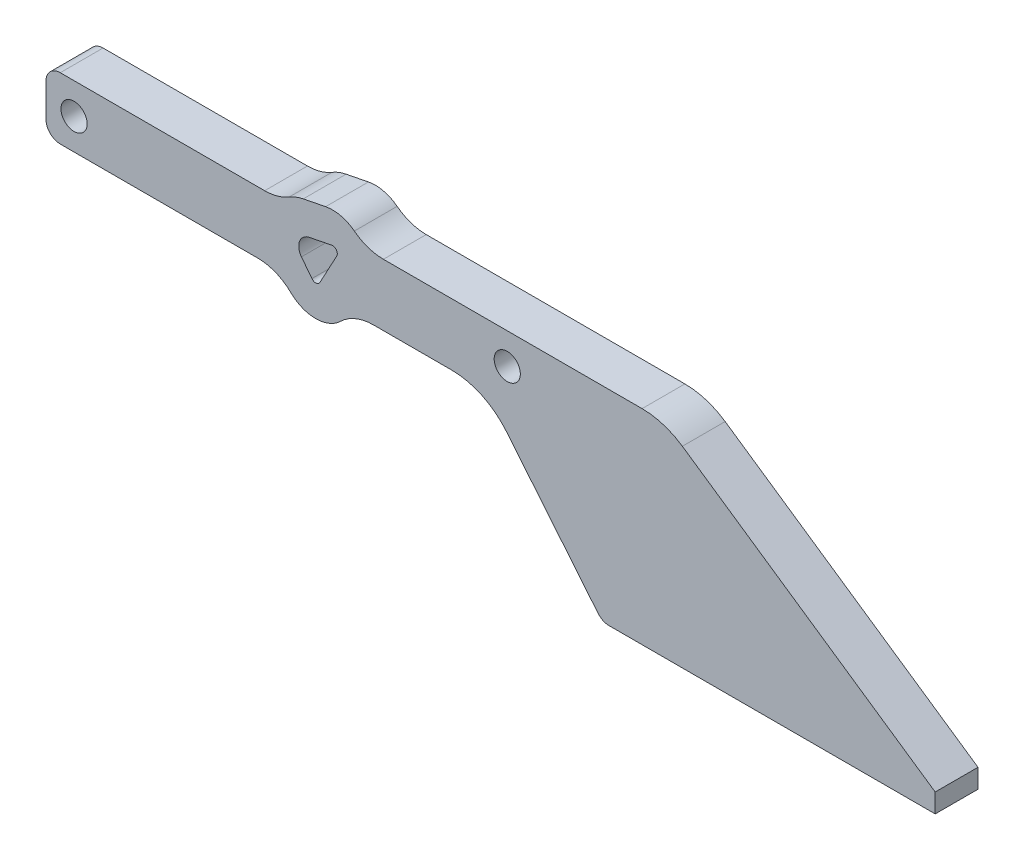
ISO-10303-21;
HEADER;
FILE_DESCRIPTION(('STEP AP214'),'2;1');
FILE_NAME('part.step','',(''),(''),'','','');
FILE_SCHEMA(('AUTOMOTIVE_DESIGN { 1 0 10303 214 1 1 1 1 }'));
ENDSEC;
DATA;
#1=APPLICATION_CONTEXT('core data for automotive mechanical design processes');
#2=APPLICATION_PROTOCOL_DEFINITION('international standard','automotive_design',2000,#1);
#3=PRODUCT_CONTEXT('',#1,'mechanical');
#4=PRODUCT('Part','Part','',(#3));
#5=PRODUCT_RELATED_PRODUCT_CATEGORY('part','',(#4));
#6=PRODUCT_DEFINITION_FORMATION('','',#4);
#7=PRODUCT_DEFINITION_CONTEXT('part definition',#1,'design');
#8=PRODUCT_DEFINITION('design','',#6,#7);
#9=PRODUCT_DEFINITION_SHAPE('','',#8);
#10=(LENGTH_UNIT() NAMED_UNIT(*) SI_UNIT(.MILLI.,.METRE.));
#11=(NAMED_UNIT(*) PLANE_ANGLE_UNIT() SI_UNIT($,.RADIAN.));
#12=(NAMED_UNIT(*) SI_UNIT($,.STERADIAN.) SOLID_ANGLE_UNIT());
#13=UNCERTAINTY_MEASURE_WITH_UNIT(LENGTH_MEASURE(1.E-05),#10,'distance_accuracy_value','');
#14=(GEOMETRIC_REPRESENTATION_CONTEXT(3) GLOBAL_UNCERTAINTY_ASSIGNED_CONTEXT((#13)) GLOBAL_UNIT_ASSIGNED_CONTEXT((#10,
#11,#12)) REPRESENTATION_CONTEXT('',''));
#15=CARTESIAN_POINT('',(0.,0.,0.));
#16=DIRECTION('',(0.,0.,1.));
#17=DIRECTION('',(1.,0.,0.));
#18=AXIS2_PLACEMENT_3D('',#15,#16,#17);
#19=CARTESIAN_POINT('',(-12.4346863309607,62.799754960396,4.5));
#20=DIRECTION('',(0.194234351219977,-0.980955155349191,0.));
#21=DIRECTION('',(0.980955155349191,0.194234351219977,0.));
#22=AXIS2_PLACEMENT_3D('',#19,#20,#21);
#23=PLANE('',#22);
#24=DIRECTION('',(-0.980955155349191,-0.194234351219977,0.));
#25=VECTOR('',#24,1.);
#26=CARTESIAN_POINT('',(-12.4346863309607,62.799754960396,-4.5));
#27=LINE('',#26,#25);
#28=CARTESIAN_POINT('',(-126.93136029778,40.1288030177724,-4.5));
#29=VERTEX_POINT('',#28);
#30=CARTESIAN_POINT('',(-131.634144465855,39.1976266772102,-4.5));
#31=VERTEX_POINT('',#30);
#32=EDGE_CURVE('E349',#29,#31,#27,.T.);
#33=ORIENTED_EDGE('',*,*,#32,.F.);
#34=DIRECTION('',(0.,0.,-1.));
#35=VECTOR('',#34,1.);
#36=CARTESIAN_POINT('',(-126.93136029778,40.1288030177724,4.5));
#37=LINE('',#36,#35);
#38=CARTESIAN_POINT('',(-126.93136029778,40.1288030177724,4.5));
#39=VERTEX_POINT('',#38);
#40=EDGE_CURVE('E380',#39,#29,#37,.T.);
#41=ORIENTED_EDGE('',*,*,#40,.F.);
#42=DIRECTION('',(-0.980955155349191,-0.194234351219977,0.));
#43=VECTOR('',#42,1.);
#44=CARTESIAN_POINT('',(-12.4346863309607,62.799754960396,4.5));
#45=LINE('',#44,#43);
#46=CARTESIAN_POINT('',(-131.634144465855,39.1976266772102,4.5));
#47=VERTEX_POINT('',#46);
#48=EDGE_CURVE('E291',#39,#47,#45,.T.);
#49=ORIENTED_EDGE('',*,*,#48,.T.);
#50=DIRECTION('',(0.,0.,-1.));
#51=VECTOR('',#50,1.);
#52=CARTESIAN_POINT('',(-131.634144465855,39.1976266772102,4.5));
#53=LINE('',#52,#51);
#54=EDGE_CURVE('E243',#47,#31,#53,.T.);
#55=ORIENTED_EDGE('',*,*,#54,.T.);
#56=EDGE_LOOP('',(#33,#41,#49,#55));
#57=FACE_BOUND('',#56,.T.);
#58=ADVANCED_FACE('F46',(#57),#23,.T.);
#59=CARTESIAN_POINT('',(-126.73712594656,39.1478478624232,4.5));
#60=DIRECTION('',(0.,0.,-1.));
#61=DIRECTION('',(-1.,0.,0.));
#62=AXIS2_PLACEMENT_3D('',#59,#60,#61);
#63=CYLINDRICAL_SURFACE('',#62,1.);
#64=CARTESIAN_POINT('',(-126.73712594656,39.1478478624232,-4.5));
#65=DIRECTION('',(0.,0.,1.));
#66=DIRECTION('',(1.,0.,0.));
#67=AXIS2_PLACEMENT_3D('',#64,#65,#66);
#68=CIRCLE('',#67,1.);
#69=CARTESIAN_POINT('',(-125.857075345755,38.6729679407337,-4.5));
#70=VERTEX_POINT('',#69);
#71=EDGE_CURVE('E352',#29,#70,#68,.F.);
#72=ORIENTED_EDGE('',*,*,#71,.T.);
#73=DIRECTION('',(0.,0.,-1.));
#74=VECTOR('',#73,1.);
#75=CARTESIAN_POINT('',(-125.857075345755,38.6729679407337,4.5));
#76=LINE('',#75,#74);
#77=CARTESIAN_POINT('',(-125.857075345755,38.6729679407337,4.5));
#78=VERTEX_POINT('',#77);
#79=EDGE_CURVE('E377',#78,#70,#76,.T.);
#80=ORIENTED_EDGE('',*,*,#79,.F.);
#81=CARTESIAN_POINT('',(-126.73712594656,39.1478478624232,4.5));
#82=DIRECTION('',(0.,0.,1.));
#83=DIRECTION('',(1.,0.,0.));
#84=AXIS2_PLACEMENT_3D('',#81,#82,#83);
#85=CIRCLE('',#84,1.);
#86=EDGE_CURVE('E294',#39,#78,#85,.F.);
#87=ORIENTED_EDGE('',*,*,#86,.F.);
#88=ORIENTED_EDGE('',*,*,#40,.T.);
#89=EDGE_LOOP('',(#72,#80,#87,#88));
#90=FACE_BOUND('',#89,.T.);
#91=ADVANCED_FACE('F505',(#90),#63,.F.);
#92=CARTESIAN_POINT('',(-113.637071329194,61.3191599261613,4.5));
#93=DIRECTION('',(0.880050600804368,-0.474879921689548,0.));
#94=DIRECTION('',(0.474879921689548,0.880050600804368,0.));
#95=AXIS2_PLACEMENT_3D('',#92,#93,#94);
#96=PLANE('',#95);
#97=DIRECTION('',(-0.474879921689548,-0.880050600804368,0.));
#98=VECTOR('',#97,1.);
#99=CARTESIAN_POINT('',(-113.637071329194,61.3191599261613,-4.5));
#100=LINE('',#99,#98);
#101=CARTESIAN_POINT('',(-129.40475054433,32.0983928800392,-4.5));
#102=VERTEX_POINT('',#101);
#103=EDGE_CURVE('E355',#70,#102,#100,.T.);
#104=ORIENTED_EDGE('',*,*,#103,.T.);
#105=DIRECTION('',(0.,0.,-1.));
#106=VECTOR('',#105,1.);
#107=CARTESIAN_POINT('',(-129.40475054433,32.0983928800392,4.5));
#108=LINE('',#107,#106);
#109=CARTESIAN_POINT('',(-129.40475054433,32.0983928800392,4.5));
#110=VERTEX_POINT('',#109);
#111=EDGE_CURVE('E375',#110,#102,#108,.T.);
#112=ORIENTED_EDGE('',*,*,#111,.F.);
#113=DIRECTION('',(-0.474879921689548,-0.880050600804368,0.));
#114=VECTOR('',#113,1.);
#115=CARTESIAN_POINT('',(-113.637071329194,61.3191599261613,4.5));
#116=LINE('',#115,#114);
#117=EDGE_CURVE('E297',#78,#110,#116,.T.);
#118=ORIENTED_EDGE('',*,*,#117,.F.);
#119=ORIENTED_EDGE('',*,*,#79,.T.);
#120=EDGE_LOOP('',(#104,#112,#118,#119));
#121=FACE_BOUND('',#120,.T.);
#122=ADVANCED_FACE('F511',(#121),#96,.F.);
#123=CARTESIAN_POINT('',(-130.284801145135,32.5732728017287,4.5));
#124=DIRECTION('',(0.,0.,-1.));
#125=DIRECTION('',(-1.,0.,0.));
#126=AXIS2_PLACEMENT_3D('',#123,#124,#125);
#127=CYLINDRICAL_SURFACE('',#126,1.00000000000001);
#128=CARTESIAN_POINT('',(-130.284801145135,32.5732728017287,-4.5));
#129=DIRECTION('',(0.,0.,1.));
#130=DIRECTION('',(1.,0.,0.));
#131=AXIS2_PLACEMENT_3D('',#128,#129,#130);
#132=CIRCLE('',#131,1.00000000000001);
#133=CARTESIAN_POINT('',(-131.07709078849,31.9631276378275,-4.5));
#134=VERTEX_POINT('',#133);
#135=EDGE_CURVE('E358',#134,#102,#132,.T.);
#136=ORIENTED_EDGE('',*,*,#135,.F.);
#137=DIRECTION('',(0.,0.,-1.));
#138=VECTOR('',#137,1.);
#139=CARTESIAN_POINT('',(-131.07709078849,31.9631276378275,4.5));
#140=LINE('',#139,#138);
#141=CARTESIAN_POINT('',(-131.07709078849,31.9631276378275,4.5));
#142=VERTEX_POINT('',#141);
#143=EDGE_CURVE('E373',#142,#134,#140,.T.);
#144=ORIENTED_EDGE('',*,*,#143,.F.);
#145=CARTESIAN_POINT('',(-130.284801145135,32.5732728017287,4.5));
#146=DIRECTION('',(0.,0.,1.));
#147=DIRECTION('',(1.,0.,0.));
#148=AXIS2_PLACEMENT_3D('',#145,#146,#147);
#149=CIRCLE('',#148,1.00000000000001);
#150=EDGE_CURVE('E299',#142,#110,#149,.T.);
#151=ORIENTED_EDGE('',*,*,#150,.T.);
#152=ORIENTED_EDGE('',*,*,#111,.T.);
#153=EDGE_LOOP('',(#136,#144,#151,#152));
#154=FACE_BOUND('',#153,.T.);
#155=ADVANCED_FACE('F771',(#154),#127,.F.);
#156=CARTESIAN_POINT('',(-66.8287391098888,-51.465057406079,4.5));
#157=DIRECTION('',(-0.792289643355201,-0.610145163901254,0.));
#158=DIRECTION('',(0.610145163901254,-0.792289643355201,0.));
#159=AXIS2_PLACEMENT_3D('',#156,#157,#158);
#160=PLANE('',#159);
#161=DIRECTION('',(-0.610145163901254,0.792289643355201,0.));
#162=VECTOR('',#161,1.);
#163=CARTESIAN_POINT('',(-66.8287391098888,-51.465057406079,-4.5));
#164=LINE('',#163,#162);
#165=CARTESIAN_POINT('',(-133.278796519227,34.8221007992715,-4.5));
#166=VERTEX_POINT('',#165);
#167=EDGE_CURVE('E361',#134,#166,#164,.T.);
#168=ORIENTED_EDGE('',*,*,#167,.T.);
#169=DIRECTION('',(0.,0.,-1.));
#170=VECTOR('',#169,1.);
#171=CARTESIAN_POINT('',(-133.278796519227,34.8221007992715,4.5));
#172=LINE('',#171,#170);
#173=CARTESIAN_POINT('',(-133.278796519227,34.8221007992715,4.5));
#174=VERTEX_POINT('',#173);
#175=EDGE_CURVE('E371',#174,#166,#172,.T.);
#176=ORIENTED_EDGE('',*,*,#175,.F.);
#177=DIRECTION('',(-0.610145163901254,0.792289643355201,0.));
#178=VECTOR('',#177,1.);
#179=CARTESIAN_POINT('',(-66.8287391098888,-51.465057406079,4.5));
#180=LINE('',#179,#178);
#181=EDGE_CURVE('E302',#142,#174,#180,.T.);
#182=ORIENTED_EDGE('',*,*,#181,.F.);
#183=ORIENTED_EDGE('',*,*,#143,.T.);
#184=EDGE_LOOP('',(#168,#176,#182,#183));
#185=FACE_BOUND('',#184,.T.);
#186=ADVANCED_FACE('F559',(#185),#160,.F.);
#187=CARTESIAN_POINT('',(0.,43.,4.5));
#188=DIRECTION('',(0.,-1.,0.));
#189=DIRECTION('',(1.,0.,0.));
#190=AXIS2_PLACEMENT_3D('',#187,#188,#189);
#191=PLANE('',#190);
#192=DIRECTION('',(-1.,0.,0.));
#193=VECTOR('',#192,1.);
#194=CARTESIAN_POINT('',(0.,43.,-4.5));
#195=LINE('',#194,#193);
#196=CARTESIAN_POINT('',(-61.6404563843569,43.,-4.5));
#197=VERTEX_POINT('',#196);
#198=CARTESIAN_POINT('',(-116.042833957025,43.,-4.5));
#199=VERTEX_POINT('',#198);
#200=EDGE_CURVE('E314',#197,#199,#195,.T.);
#201=ORIENTED_EDGE('',*,*,#200,.T.);
#202=DIRECTION('',(0.,0.,-1.));
#203=VECTOR('',#202,1.);
#204=CARTESIAN_POINT('',(-116.042833957025,43.,4.5));
#205=LINE('',#204,#203);
#206=CARTESIAN_POINT('',(-116.042833957025,43.,4.5));
#207=VERTEX_POINT('',#206);
#208=EDGE_CURVE('E416',#199,#207,#205,.F.);
#209=ORIENTED_EDGE('',*,*,#208,.T.);
#210=DIRECTION('',(-1.,0.,0.));
#211=VECTOR('',#210,1.);
#212=CARTESIAN_POINT('',(0.,43.,4.5));
#213=LINE('',#212,#211);
#214=CARTESIAN_POINT('',(-61.6404563843569,43.,4.5));
#215=VERTEX_POINT('',#214);
#216=EDGE_CURVE('E260',#215,#207,#213,.T.);
#217=ORIENTED_EDGE('',*,*,#216,.F.);
#218=DIRECTION('',(0.,0.,-1.));
#219=VECTOR('',#218,1.);
#220=CARTESIAN_POINT('',(-61.6404563843569,43.,-4.5));
#221=LINE('',#220,#219);
#222=EDGE_CURVE('E393',#215,#197,#221,.T.);
#223=ORIENTED_EDGE('',*,*,#222,.T.);
#224=EDGE_LOOP('',(#201,#209,#217,#223));
#225=FACE_BOUND('',#224,.T.);
#226=ADVANCED_FACE('F487',(#225),#191,.F.);
#227=CARTESIAN_POINT('',(-126.73712594656,39.1478478624232,4.5));
#228=DIRECTION('',(0.,0.,-1.));
#229=DIRECTION('',(-1.,0.,0.));
#230=AXIS2_PLACEMENT_3D('',#227,#228,#229);
#231=CYLINDRICAL_SURFACE('',#230,7.5);
#232=CARTESIAN_POINT('',(-126.73712594656,39.1478478624232,4.5));
#233=DIRECTION('',(0.,0.,1.));
#234=DIRECTION('',(1.,0.,0.));
#235=AXIS2_PLACEMENT_3D('',#232,#233,#234);
#236=CIRCLE('',#235,7.5);
#237=CARTESIAN_POINT('',(-128.19388358071,46.5050115275422,4.5));
#238=VERTEX_POINT('',#237);
#239=CARTESIAN_POINT('',(-122.153857951045,45.0844844928133,4.5));
#240=VERTEX_POINT('',#239);
#241=EDGE_CURVE('E237',#238,#240,#236,.F.);
#242=ORIENTED_EDGE('',*,*,#241,.T.);
#243=DIRECTION('',(0.,0.,-1.));
#244=VECTOR('',#243,1.);
#245=CARTESIAN_POINT('',(-122.153857951045,45.0844844928133,4.5));
#246=LINE('',#245,#244);
#247=CARTESIAN_POINT('',(-122.153857951045,45.0844844928133,-4.5));
#248=VERTEX_POINT('',#247);
#249=EDGE_CURVE('E414',#240,#248,#246,.T.);
#250=ORIENTED_EDGE('',*,*,#249,.T.);
#251=CARTESIAN_POINT('',(-126.73712594656,39.1478478624232,-4.5));
#252=DIRECTION('',(0.,0.,1.));
#253=DIRECTION('',(1.,0.,0.));
#254=AXIS2_PLACEMENT_3D('',#251,#252,#253);
#255=CIRCLE('',#254,7.5);
#256=CARTESIAN_POINT('',(-128.19388358071,46.5050115275422,-4.5));
#257=VERTEX_POINT('',#256);
#258=EDGE_CURVE('E240',#257,#248,#255,.F.);
#259=ORIENTED_EDGE('',*,*,#258,.F.);
#260=DIRECTION('',(0.,0.,-1.));
#261=VECTOR('',#260,1.);
#262=CARTESIAN_POINT('',(-128.19388358071,46.5050115275422,4.5));
#263=LINE('',#262,#261);
#264=EDGE_CURVE('E232',#238,#257,#263,.T.);
#265=ORIENTED_EDGE('',*,*,#264,.F.);
#266=EDGE_LOOP('',(#242,#250,#259,#265));
#267=FACE_BOUND('',#266,.T.);
#268=ADVANCED_FACE('F234',(#267),#231,.T.);
#269=CARTESIAN_POINT('',(-13.6972096138902,69.1759634701653,4.5));
#270=DIRECTION('',(0.194234351219973,-0.980955155349191,0.));
#271=DIRECTION('',(0.980955155349192,0.194234351219973,0.));
#272=AXIS2_PLACEMENT_3D('',#269,#270,#271);
#273=PLANE('',#272);
#274=DIRECTION('',(-0.980955155349191,-0.194234351219973,0.));
#275=VECTOR('',#274,1.);
#276=CARTESIAN_POINT('',(-13.6972096138902,69.1759634701653,-4.5));
#277=LINE('',#276,#275);
#278=CARTESIAN_POINT('',(-132.896667748785,45.57383518698,-4.5));
#279=VERTEX_POINT('',#278);
#280=EDGE_CURVE('E318',#257,#279,#277,.T.);
#281=ORIENTED_EDGE('',*,*,#280,.T.);
#282=DIRECTION('',(0.,0.,-1.));
#283=VECTOR('',#282,1.);
#284=CARTESIAN_POINT('',(-132.896667748785,45.57383518698,4.5));
#285=LINE('',#284,#283);
#286=CARTESIAN_POINT('',(-132.896667748785,45.57383518698,4.5));
#287=VERTEX_POINT('',#286);
#288=EDGE_CURVE('E244',#287,#279,#285,.T.);
#289=ORIENTED_EDGE('',*,*,#288,.F.);
#290=DIRECTION('',(-0.980955155349191,-0.194234351219973,0.));
#291=VECTOR('',#290,1.);
#292=CARTESIAN_POINT('',(-13.6972096138902,69.1759634701653,4.5));
#293=LINE('',#292,#291);
#294=EDGE_CURVE('E247',#238,#287,#293,.T.);
#295=ORIENTED_EDGE('',*,*,#294,.F.);
#296=ORIENTED_EDGE('',*,*,#264,.T.);
#297=EDGE_LOOP('',(#281,#289,#295,#296));
#298=FACE_BOUND('',#297,.T.);
#299=ADVANCED_FACE('F248',(#298),#273,.F.);
#300=CARTESIAN_POINT('',(-131.1,36.5,4.5));
#301=DIRECTION('',(0.,0.,-1.));
#302=DIRECTION('',(-1.,0.,0.));
#303=AXIS2_PLACEMENT_3D('',#300,#301,#302);
#304=CYLINDRICAL_SURFACE('',#303,9.24999999999999);
#305=CARTESIAN_POINT('',(-131.1,36.5,-4.5));
#306=DIRECTION('',(0.,0.,1.));
#307=DIRECTION('',(1.,0.,0.));
#308=AXIS2_PLACEMENT_3D('',#305,#306,#307);
#309=CIRCLE('',#308,9.24999999999999);
#310=CARTESIAN_POINT('',(-135.864478471149,44.4285714285714,-4.5));
#311=VERTEX_POINT('',#310);
#312=EDGE_CURVE('E320',#279,#311,#309,.T.);
#313=ORIENTED_EDGE('',*,*,#312,.T.);
#314=DIRECTION('',(0.,0.,-1.));
#315=VECTOR('',#314,1.);
#316=CARTESIAN_POINT('',(-135.864478471149,44.4285714285714,4.5));
#317=LINE('',#316,#315);
#318=CARTESIAN_POINT('',(-135.864478471149,44.4285714285714,4.5));
#319=VERTEX_POINT('',#318);
#320=EDGE_CURVE('E421',#311,#319,#317,.F.);
#321=ORIENTED_EDGE('',*,*,#320,.T.);
#322=CARTESIAN_POINT('',(-131.1,36.5,4.5));
#323=DIRECTION('',(0.,0.,1.));
#324=DIRECTION('',(1.,0.,0.));
#325=AXIS2_PLACEMENT_3D('',#322,#323,#324);
#326=CIRCLE('',#325,9.24999999999999);
#327=EDGE_CURVE('E252',#287,#319,#326,.T.);
#328=ORIENTED_EDGE('',*,*,#327,.F.);
#329=ORIENTED_EDGE('',*,*,#288,.T.);
#330=EDGE_LOOP('',(#313,#321,#328,#329));
#331=FACE_BOUND('',#330,.T.);
#332=ADVANCED_FACE('F548',(#331),#304,.T.);
#333=CARTESIAN_POINT('',(0.,43.,4.5));
#334=DIRECTION('',(0.,-1.,0.));
#335=DIRECTION('',(1.,0.,0.));
#336=AXIS2_PLACEMENT_3D('',#333,#334,#335);
#337=PLANE('',#336);
#338=DIRECTION('',(-1.,0.,0.));
#339=VECTOR('',#338,1.);
#340=CARTESIAN_POINT('',(0.,43.,-4.5));
#341=LINE('',#340,#339);
#342=CARTESIAN_POINT('',(-141.015266007526,43.,-4.5));
#343=VERTEX_POINT('',#342);
#344=CARTESIAN_POINT('',(-184.,43.,-4.5));
#345=VERTEX_POINT('',#344);
#346=EDGE_CURVE('E323',#343,#345,#341,.T.);
#347=ORIENTED_EDGE('',*,*,#346,.T.);
#348=DIRECTION('',(0.,0.,-1.));
#349=VECTOR('',#348,1.);
#350=CARTESIAN_POINT('',(-184.,43.,4.5));
#351=LINE('',#350,#349);
#352=CARTESIAN_POINT('',(-184.,43.,4.5));
#353=VERTEX_POINT('',#352);
#354=EDGE_CURVE('E451',#345,#353,#351,.F.);
#355=ORIENTED_EDGE('',*,*,#354,.T.);
#356=DIRECTION('',(-1.,0.,0.));
#357=VECTOR('',#356,1.);
#358=CARTESIAN_POINT('',(0.,43.,4.5));
#359=LINE('',#358,#357);
#360=CARTESIAN_POINT('',(-141.015266007526,43.,4.5));
#361=VERTEX_POINT('',#360);
#362=EDGE_CURVE('E268',#361,#353,#359,.T.);
#363=ORIENTED_EDGE('',*,*,#362,.F.);
#364=DIRECTION('',(0.,0.,1.));
#365=VECTOR('',#364,1.);
#366=CARTESIAN_POINT('',(-141.015266007526,43.,-4.5));
#367=LINE('',#366,#365);
#368=EDGE_CURVE('E418',#361,#343,#367,.F.);
#369=ORIENTED_EDGE('',*,*,#368,.T.);
#370=EDGE_LOOP('',(#347,#355,#363,#369));
#371=FACE_BOUND('',#370,.T.);
#372=ADVANCED_FACE('F544',(#371),#337,.F.);
#373=CARTESIAN_POINT('',(-187.,0.,4.5));
#374=DIRECTION('',(1.,0.,0.));
#375=DIRECTION('',(0.,0.,-1.));
#376=AXIS2_PLACEMENT_3D('',#373,#374,#375);
#377=PLANE('',#376);
#378=DIRECTION('',(0.,-1.,0.));
#379=VECTOR('',#378,1.);
#380=CARTESIAN_POINT('',(-187.,0.,4.5));
#381=LINE('',#380,#379);
#382=CARTESIAN_POINT('',(-187.,40.,4.5));
#383=VERTEX_POINT('',#382);
#384=CARTESIAN_POINT('',(-187.,33.,4.5));
#385=VERTEX_POINT('',#384);
#386=EDGE_CURVE('E270',#383,#385,#381,.T.);
#387=ORIENTED_EDGE('',*,*,#386,.F.);
#388=DIRECTION('',(0.,0.,-1.));
#389=VECTOR('',#388,1.);
#390=CARTESIAN_POINT('',(-187.,40.,4.5));
#391=LINE('',#390,#389);
#392=CARTESIAN_POINT('',(-187.,40.,-4.5));
#393=VERTEX_POINT('',#392);
#394=EDGE_CURVE('E442',#383,#393,#391,.T.);
#395=ORIENTED_EDGE('',*,*,#394,.T.);
#396=DIRECTION('',(0.,-1.,0.));
#397=VECTOR('',#396,1.);
#398=CARTESIAN_POINT('',(-187.,0.,-4.5));
#399=LINE('',#398,#397);
#400=CARTESIAN_POINT('',(-187.,33.,-4.5));
#401=VERTEX_POINT('',#400);
#402=EDGE_CURVE('E326',#393,#401,#399,.T.);
#403=ORIENTED_EDGE('',*,*,#402,.T.);
#404=DIRECTION('',(0.,0.,-1.));
#405=VECTOR('',#404,1.);
#406=CARTESIAN_POINT('',(-187.,33.,4.5));
#407=LINE('',#406,#405);
#408=EDGE_CURVE('E440',#401,#385,#407,.F.);
#409=ORIENTED_EDGE('',*,*,#408,.T.);
#410=EDGE_LOOP('',(#387,#395,#403,#409));
#411=FACE_BOUND('',#410,.T.);
#412=ADVANCED_FACE('F540',(#411),#377,.F.);
#413=CARTESIAN_POINT('',(0.,30.,4.5));
#414=DIRECTION('',(0.,-1.,0.));
#415=DIRECTION('',(1.,0.,0.));
#416=AXIS2_PLACEMENT_3D('',#413,#414,#415);
#417=PLANE('',#416);
#418=DIRECTION('',(-1.,0.,0.));
#419=VECTOR('',#418,1.);
#420=CARTESIAN_POINT('',(0.,30.,4.5));
#421=LINE('',#420,#419);
#422=CARTESIAN_POINT('',(-142.457015859529,30.,4.5));
#423=VERTEX_POINT('',#422);
#424=CARTESIAN_POINT('',(-184.,30.,4.5));
#425=VERTEX_POINT('',#424);
#426=EDGE_CURVE('E273',#423,#425,#421,.T.);
#427=ORIENTED_EDGE('',*,*,#426,.T.);
#428=DIRECTION('',(0.,0.,-1.));
#429=VECTOR('',#428,1.);
#430=CARTESIAN_POINT('',(-184.,30.,-4.5));
#431=LINE('',#430,#429);
#432=CARTESIAN_POINT('',(-184.,30.,-4.5));
#433=VERTEX_POINT('',#432);
#434=EDGE_CURVE('E458',#425,#433,#431,.T.);
#435=ORIENTED_EDGE('',*,*,#434,.T.);
#436=DIRECTION('',(-1.,0.,0.));
#437=VECTOR('',#436,1.);
#438=CARTESIAN_POINT('',(0.,30.,-4.5));
#439=LINE('',#438,#437);
#440=CARTESIAN_POINT('',(-142.457015859529,30.,-4.5));
#441=VERTEX_POINT('',#440);
#442=EDGE_CURVE('E329',#441,#433,#439,.T.);
#443=ORIENTED_EDGE('',*,*,#442,.F.);
#444=DIRECTION('',(0.,0.,-1.));
#445=VECTOR('',#444,1.);
#446=CARTESIAN_POINT('',(-142.457015859529,30.,4.5));
#447=LINE('',#446,#445);
#448=EDGE_CURVE('E423',#441,#423,#447,.F.);
#449=ORIENTED_EDGE('',*,*,#448,.T.);
#450=EDGE_LOOP('',(#427,#435,#443,#449));
#451=FACE_BOUND('',#450,.T.);
#452=ADVANCED_FACE('F536',(#451),#417,.T.);
#453=CARTESIAN_POINT('',(-130.284801145135,32.5732728017287,4.5));
#454=DIRECTION('',(0.,0.,-1.));
#455=DIRECTION('',(-1.,0.,0.));
#456=AXIS2_PLACEMENT_3D('',#453,#454,#455);
#457=CYLINDRICAL_SURFACE('',#456,7.50000000000001);
#458=CARTESIAN_POINT('',(-130.284801145135,32.5732728017287,-4.5));
#459=DIRECTION('',(0.,0.,1.));
#460=DIRECTION('',(1.,0.,0.));
#461=AXIS2_PLACEMENT_3D('',#458,#459,#460);
#462=CIRCLE('',#461,7.50000000000001);
#463=CARTESIAN_POINT('',(-135.501464594161,27.1847273152735,-4.5));
#464=VERTEX_POINT('',#463);
#465=CARTESIAN_POINT('',(-125.068137696109,27.1847273152735,-4.5));
#466=VERTEX_POINT('',#465);
#467=EDGE_CURVE('E332',#464,#466,#462,.T.);
#468=ORIENTED_EDGE('',*,*,#467,.T.);
#469=DIRECTION('',(0.,0.,-1.));
#470=VECTOR('',#469,1.);
#471=CARTESIAN_POINT('',(-125.068137696109,27.1847273152736,4.5));
#472=LINE('',#471,#470);
#473=CARTESIAN_POINT('',(-125.068137696109,27.1847273152735,4.5));
#474=VERTEX_POINT('',#473);
#475=EDGE_CURVE('E412',#466,#474,#472,.F.);
#476=ORIENTED_EDGE('',*,*,#475,.T.);
#477=CARTESIAN_POINT('',(-130.284801145135,32.5732728017287,4.5));
#478=DIRECTION('',(0.,0.,1.));
#479=DIRECTION('',(1.,0.,0.));
#480=AXIS2_PLACEMENT_3D('',#477,#478,#479);
#481=CIRCLE('',#480,7.50000000000001);
#482=CARTESIAN_POINT('',(-135.501464594161,27.1847273152735,4.5));
#483=VERTEX_POINT('',#482);
#484=EDGE_CURVE('E276',#483,#474,#481,.T.);
#485=ORIENTED_EDGE('',*,*,#484,.F.);
#486=DIRECTION('',(0.,0.,-1.));
#487=VECTOR('',#486,1.);
#488=CARTESIAN_POINT('',(-135.501464594161,27.1847273152736,4.5));
#489=LINE('',#488,#487);
#490=EDGE_CURVE('E409',#483,#464,#489,.T.);
#491=ORIENTED_EDGE('',*,*,#490,.T.);
#492=EDGE_LOOP('',(#468,#476,#485,#491));
#493=FACE_BOUND('',#492,.T.);
#494=ADVANCED_FACE('F532',(#493),#457,.T.);
#495=CARTESIAN_POINT('',(0.,30.,4.5));
#496=DIRECTION('',(0.,-1.,0.));
#497=DIRECTION('',(1.,0.,0.));
#498=AXIS2_PLACEMENT_3D('',#495,#496,#497);
#499=PLANE('',#498);
#500=DIRECTION('',(-1.,0.,0.));
#501=VECTOR('',#500,1.);
#502=CARTESIAN_POINT('',(0.,30.,4.5));
#503=LINE('',#502,#501);
#504=CARTESIAN_POINT('',(-101.729457735111,30.,4.5));
#505=VERTEX_POINT('',#504);
#506=CARTESIAN_POINT('',(-118.112586430741,30.,4.5));
#507=VERTEX_POINT('',#506);
#508=EDGE_CURVE('E279',#505,#507,#503,.T.);
#509=ORIENTED_EDGE('',*,*,#508,.T.);
#510=DIRECTION('',(0.,0.,-1.));
#511=VECTOR('',#510,1.);
#512=CARTESIAN_POINT('',(-118.112586430741,30.,4.5));
#513=LINE('',#512,#511);
#514=CARTESIAN_POINT('',(-118.112586430741,30.,-4.5));
#515=VERTEX_POINT('',#514);
#516=EDGE_CURVE('E406',#507,#515,#513,.T.);
#517=ORIENTED_EDGE('',*,*,#516,.T.);
#518=DIRECTION('',(-1.,0.,0.));
#519=VECTOR('',#518,1.);
#520=CARTESIAN_POINT('',(0.,30.,-4.5));
#521=LINE('',#520,#519);
#522=CARTESIAN_POINT('',(-101.729457735111,30.,-4.5));
#523=VERTEX_POINT('',#522);
#524=EDGE_CURVE('E335',#523,#515,#521,.T.);
#525=ORIENTED_EDGE('',*,*,#524,.F.);
#526=DIRECTION('',(0.,0.,-1.));
#527=VECTOR('',#526,1.);
#528=CARTESIAN_POINT('',(-101.729457735111,30.,4.5));
#529=LINE('',#528,#527);
#530=EDGE_CURVE('E390',#523,#505,#529,.F.);
#531=ORIENTED_EDGE('',*,*,#530,.T.);
#532=EDGE_LOOP('',(#509,#517,#525,#531));
#533=FACE_BOUND('',#532,.T.);
#534=ADVANCED_FACE('F529',(#533),#499,.T.);
#535=CARTESIAN_POINT('',(-41.8036999531151,-34.3323414137163,4.5));
#536=DIRECTION('',(0.772784390121805,0.634668642981572,0.));
#537=DIRECTION('',(-0.634668642981572,0.772784390121805,0.));
#538=AXIS2_PLACEMENT_3D('',#535,#536,#537);
#539=PLANE('',#538);
#540=DIRECTION('',(0.634668642981572,-0.772784390121805,0.));
#541=VECTOR('',#540,1.);
#542=CARTESIAN_POINT('',(-41.8036999531151,-34.3323414137163,-4.5));
#543=LINE('',#542,#541);
#544=CARTESIAN_POINT('',(-90.1376918832842,24.5200296447236,-4.5));
#545=VERTEX_POINT('',#544);
#546=CARTESIAN_POINT('',(-70.900112733492,1.09599407105527,-4.5));
#547=VERTEX_POINT('',#546);
#548=EDGE_CURVE('E339',#545,#547,#543,.T.);
#549=ORIENTED_EDGE('',*,*,#548,.T.);
#550=DIRECTION('',(0.,0.,-1.));
#551=VECTOR('',#550,1.);
#552=CARTESIAN_POINT('',(-70.900112733492,1.09599407105528,4.5));
#553=LINE('',#552,#551);
#554=CARTESIAN_POINT('',(-70.900112733492,1.09599407105527,4.5));
#555=VERTEX_POINT('',#554);
#556=EDGE_CURVE('E12',#547,#555,#553,.F.);
#557=ORIENTED_EDGE('',*,*,#556,.T.);
#558=DIRECTION('',(0.634668642981572,-0.772784390121805,0.));
#559=VECTOR('',#558,1.);
#560=CARTESIAN_POINT('',(-41.8036999531151,-34.3323414137163,4.5));
#561=LINE('',#560,#559);
#562=CARTESIAN_POINT('',(-90.1376918832842,24.5200296447236,4.5));
#563=VERTEX_POINT('',#562);
#564=EDGE_CURVE('E282',#563,#555,#561,.T.);
#565=ORIENTED_EDGE('',*,*,#564,.F.);
#566=DIRECTION('',(0.,0.,-1.));
#567=VECTOR('',#566,1.);
#568=CARTESIAN_POINT('',(-90.1376918832842,24.5200296447236,4.5));
#569=LINE('',#568,#567);
#570=EDGE_CURVE('E382',#563,#545,#569,.T.);
#571=ORIENTED_EDGE('',*,*,#570,.T.);
#572=EDGE_LOOP('',(#549,#557,#565,#571));
#573=FACE_BOUND('',#572,.T.);
#574=ADVANCED_FACE('F526',(#573),#539,.F.);
#575=CARTESIAN_POINT('',(0.,0.,4.5));
#576=DIRECTION('',(0.,-1.,0.));
#577=DIRECTION('',(1.,0.,0.));
#578=AXIS2_PLACEMENT_3D('',#575,#576,#577);
#579=PLANE('',#578);
#580=DIRECTION('',(-1.,0.,0.));
#581=VECTOR('',#580,1.);
#582=CARTESIAN_POINT('',(0.,0.,4.5));
#583=LINE('',#582,#581);
#584=CARTESIAN_POINT('',(0.,0.,4.5));
#585=VERTEX_POINT('',#584);
#586=CARTESIAN_POINT('',(-68.5817595631266,0.,4.5));
#587=VERTEX_POINT('',#586);
#588=EDGE_CURVE('E284',#585,#587,#583,.T.);
#589=ORIENTED_EDGE('',*,*,#588,.T.);
#590=DIRECTION('',(0.,0.,-1.));
#591=VECTOR('',#590,1.);
#592=CARTESIAN_POINT('',(-68.5817595631266,0.,-4.5));
#593=LINE('',#592,#591);
#594=CARTESIAN_POINT('',(-68.5817595631266,0.,-4.5));
#595=VERTEX_POINT('',#594);
#596=EDGE_CURVE('E54',#587,#595,#593,.T.);
#597=ORIENTED_EDGE('',*,*,#596,.T.);
#598=DIRECTION('',(-1.,0.,0.));
#599=VECTOR('',#598,1.);
#600=CARTESIAN_POINT('',(0.,0.,-4.5));
#601=LINE('',#600,#599);
#602=CARTESIAN_POINT('',(0.,0.,-4.5));
#603=VERTEX_POINT('',#602);
#604=EDGE_CURVE('E340',#603,#595,#601,.T.);
#605=ORIENTED_EDGE('',*,*,#604,.F.);
#606=DIRECTION('',(0.,0.,-1.));
#607=VECTOR('',#606,1.);
#608=CARTESIAN_POINT('',(0.,0.,4.5));
#609=LINE('',#608,#607);
#610=EDGE_CURVE('E385',#585,#603,#609,.T.);
#611=ORIENTED_EDGE('',*,*,#610,.F.);
#612=EDGE_LOOP('',(#589,#597,#605,#611));
#613=FACE_BOUND('',#612,.T.);
#614=ADVANCED_FACE('F464',(#613),#579,.T.);
#615=CARTESIAN_POINT('',(0.,0.,4.5));
#616=DIRECTION('',(-1.,0.,0.));
#617=DIRECTION('',(0.,0.,1.));
#618=AXIS2_PLACEMENT_3D('',#615,#616,#617);
#619=PLANE('',#618);
#620=DIRECTION('',(0.,1.,0.));
#621=VECTOR('',#620,1.);
#622=CARTESIAN_POINT('',(0.,0.,-4.5));
#623=LINE('',#622,#621);
#624=CARTESIAN_POINT('',(0.,4.,-4.5));
#625=VERTEX_POINT('',#624);
#626=EDGE_CURVE('E344',#603,#625,#623,.T.);
#627=ORIENTED_EDGE('',*,*,#626,.T.);
#628=DIRECTION('',(0.,0.,-1.));
#629=VECTOR('',#628,1.);
#630=CARTESIAN_POINT('',(0.,4.,4.5));
#631=LINE('',#630,#629);
#632=CARTESIAN_POINT('',(0.,4.,4.5));
#633=VERTEX_POINT('',#632);
#634=EDGE_CURVE('E310',#633,#625,#631,.T.);
#635=ORIENTED_EDGE('',*,*,#634,.F.);
#636=DIRECTION('',(0.,1.,0.));
#637=VECTOR('',#636,1.);
#638=CARTESIAN_POINT('',(0.,0.,4.5));
#639=LINE('',#638,#637);
#640=EDGE_CURVE('E286',#585,#633,#639,.T.);
#641=ORIENTED_EDGE('',*,*,#640,.F.);
#642=ORIENTED_EDGE('',*,*,#610,.T.);
#643=EDGE_LOOP('',(#627,#635,#641,#642));
#644=FACE_BOUND('',#643,.T.);
#645=ADVANCED_FACE('F475',(#644),#619,.F.);
#646=CARTESIAN_POINT('',(-131.1,36.5,4.5));
#647=DIRECTION('',(0.,0.,-1.));
#648=DIRECTION('',(-1.,0.,0.));
#649=AXIS2_PLACEMENT_3D('',#646,#647,#648);
#650=CYLINDRICAL_SURFACE('',#649,2.74999999999999);
#651=CARTESIAN_POINT('',(-131.1,36.5,-4.5));
#652=DIRECTION('',(0.,0.,1.));
#653=DIRECTION('',(1.,0.,0.));
#654=AXIS2_PLACEMENT_3D('',#651,#652,#653);
#655=CIRCLE('',#654,2.74999999999999);
#656=EDGE_CURVE('E364',#31,#166,#655,.T.);
#657=ORIENTED_EDGE('',*,*,#656,.F.);
#658=ORIENTED_EDGE('',*,*,#54,.F.);
#659=CARTESIAN_POINT('',(-131.1,36.5,4.5));
#660=DIRECTION('',(0.,0.,1.));
#661=DIRECTION('',(1.,0.,0.));
#662=AXIS2_PLACEMENT_3D('',#659,#660,#661);
#663=CIRCLE('',#662,2.74999999999999);
#664=EDGE_CURVE('E304',#47,#174,#663,.T.);
#665=ORIENTED_EDGE('',*,*,#664,.T.);
#666=ORIENTED_EDGE('',*,*,#175,.T.);
#667=EDGE_LOOP('',(#657,#658,#665,#666));
#668=FACE_BOUND('',#667,.T.);
#669=ADVANCED_FACE('F521',(#668),#650,.F.);
#670=CARTESIAN_POINT('',(1.86415094339622,2.72452830188679,4.5));
#671=DIRECTION('',(0.56468391559199,0.825307261249832,0.));
#672=DIRECTION('',(-0.825307261249832,0.56468391559199,0.));
#673=AXIS2_PLACEMENT_3D('',#670,#671,#672);
#674=PLANE('',#673);
#675=DIRECTION('',(0.825307261249832,-0.56468391559199,0.));
#676=VECTOR('',#675,1.);
#677=CARTESIAN_POINT('',(1.86415094339622,2.72452830188679,-4.5));
#678=LINE('',#677,#676);
#679=CARTESIAN_POINT('',(-53.1701976504771,40.3796089187475,-4.5));
#680=VERTEX_POINT('',#679);
#681=EDGE_CURVE('E347',#680,#625,#678,.T.);
#682=ORIENTED_EDGE('',*,*,#681,.F.);
#683=DIRECTION('',(0.,0.,-1.));
#684=VECTOR('',#683,1.);
#685=CARTESIAN_POINT('',(-53.1701976504771,40.3796089187475,4.5));
#686=LINE('',#685,#684);
#687=CARTESIAN_POINT('',(-53.1701976504771,40.3796089187475,4.5));
#688=VERTEX_POINT('',#687);
#689=EDGE_CURVE('E398',#680,#688,#686,.F.);
#690=ORIENTED_EDGE('',*,*,#689,.T.);
#691=DIRECTION('',(0.825307261249832,-0.56468391559199,0.));
#692=VECTOR('',#691,1.);
#693=CARTESIAN_POINT('',(1.86415094339622,2.72452830188679,4.5));
#694=LINE('',#693,#692);
#695=EDGE_CURVE('E289',#688,#633,#694,.T.);
#696=ORIENTED_EDGE('',*,*,#695,.T.);
#697=ORIENTED_EDGE('',*,*,#634,.T.);
#698=EDGE_LOOP('',(#682,#690,#696,#697));
#699=FACE_BOUND('',#698,.T.);
#700=ADVANCED_FACE('F517',(#699),#674,.T.);
#701=CARTESIAN_POINT('',(-90.,36.5,4.5));
#702=DIRECTION('',(0.,0.,-1.));
#703=DIRECTION('',(-1.,0.,0.));
#704=AXIS2_PLACEMENT_3D('',#701,#702,#703);
#705=CYLINDRICAL_SURFACE('',#704,2.75000000000001);
#706=CARTESIAN_POINT('',(-90.,36.5,4.5));
#707=DIRECTION('',(0.,0.,1.));
#708=DIRECTION('',(1.,0.,0.));
#709=AXIS2_PLACEMENT_3D('',#706,#707,#708);
#710=CIRCLE('',#709,2.75000000000001);
#711=CARTESIAN_POINT('',(-87.25,36.5,4.5));
#712=VERTEX_POINT('',#711);
#713=EDGE_CURVE('E263',#712,#712,#710,.T.);
#714=ORIENTED_EDGE('',*,*,#713,.T.);
#715=EDGE_LOOP('',(#714));
#716=FACE_BOUND('',#715,.T.);
#717=CARTESIAN_POINT('',(-90.,36.5,-4.5));
#718=DIRECTION('',(0.,0.,1.));
#719=DIRECTION('',(1.,0.,0.));
#720=AXIS2_PLACEMENT_3D('',#717,#718,#719);
#721=CIRCLE('',#720,2.75000000000001);
#722=CARTESIAN_POINT('',(-87.25,36.5,-4.5));
#723=VERTEX_POINT('',#722);
#724=EDGE_CURVE('E311',#723,#723,#721,.T.);
#725=ORIENTED_EDGE('',*,*,#724,.F.);
#726=EDGE_LOOP('',(#725));
#727=FACE_BOUND('',#726,.T.);
#728=ADVANCED_FACE('F520',(#716,#727),#705,.F.);
#729=CARTESIAN_POINT('',(-181.1,36.5,4.5));
#730=DIRECTION('',(0.,0.,-1.));
#731=DIRECTION('',(-1.,0.,0.));
#732=AXIS2_PLACEMENT_3D('',#729,#730,#731);
#733=CYLINDRICAL_SURFACE('',#732,2.75000000000001);
#734=CARTESIAN_POINT('',(-181.1,36.5,4.5));
#735=DIRECTION('',(0.,0.,1.));
#736=DIRECTION('',(1.,0.,0.));
#737=AXIS2_PLACEMENT_3D('',#734,#735,#736);
#738=CIRCLE('',#737,2.75000000000001);
#739=CARTESIAN_POINT('',(-178.35,36.5,4.5));
#740=VERTEX_POINT('',#739);
#741=EDGE_CURVE('E307',#740,#740,#738,.T.);
#742=ORIENTED_EDGE('',*,*,#741,.T.);
#743=EDGE_LOOP('',(#742));
#744=FACE_BOUND('',#743,.T.);
#745=CARTESIAN_POINT('',(-181.1,36.5,-4.5));
#746=DIRECTION('',(0.,0.,1.));
#747=DIRECTION('',(1.,0.,0.));
#748=AXIS2_PLACEMENT_3D('',#745,#746,#747);
#749=CIRCLE('',#748,2.75000000000001);
#750=CARTESIAN_POINT('',(-178.35,36.5,-4.5));
#751=VERTEX_POINT('',#750);
#752=EDGE_CURVE('E367',#751,#751,#749,.T.);
#753=ORIENTED_EDGE('',*,*,#752,.F.);
#754=EDGE_LOOP('',(#753));
#755=FACE_BOUND('',#754,.T.);
#756=ADVANCED_FACE('F562',(#744,#755),#733,.F.);
#757=CARTESIAN_POINT('',(0.,0.,4.5));
#758=DIRECTION('',(0.,0.,1.));
#759=DIRECTION('',(1.,0.,0.));
#760=AXIS2_PLACEMENT_3D('',#757,#758,#759);
#761=PLANE('',#760);
#762=ORIENTED_EDGE('',*,*,#713,.F.);
#763=EDGE_LOOP('',(#762));
#764=FACE_BOUND('',#763,.T.);
#765=ORIENTED_EDGE('',*,*,#362,.T.);
#766=CARTESIAN_POINT('',(-184.,40.,4.5));
#767=DIRECTION('',(0.,0.,1.));
#768=DIRECTION('',(1.,0.,0.));
#769=AXIS2_PLACEMENT_3D('',#766,#767,#768);
#770=CIRCLE('',#769,3.);
#771=EDGE_CURVE('E456',#353,#383,#770,.T.);
#772=ORIENTED_EDGE('',*,*,#771,.T.);
#773=ORIENTED_EDGE('',*,*,#386,.T.);
#774=CARTESIAN_POINT('',(-184.,33.,4.5));
#775=DIRECTION('',(0.,0.,1.));
#776=DIRECTION('',(1.,0.,0.));
#777=AXIS2_PLACEMENT_3D('',#774,#775,#776);
#778=CIRCLE('',#777,3.);
#779=EDGE_CURVE('E454',#385,#425,#778,.T.);
#780=ORIENTED_EDGE('',*,*,#779,.T.);
#781=ORIENTED_EDGE('',*,*,#426,.F.);
#782=CARTESIAN_POINT('',(-142.457015859529,20.,4.5));
#783=DIRECTION('',(0.,0.,1.));
#784=DIRECTION('',(1.,0.,0.));
#785=AXIS2_PLACEMENT_3D('',#782,#783,#784);
#786=CIRCLE('',#785,10.);
#787=EDGE_CURVE('E438',#423,#483,#786,.F.);
#788=ORIENTED_EDGE('',*,*,#787,.T.);
#789=ORIENTED_EDGE('',*,*,#484,.T.);
#790=CARTESIAN_POINT('',(-118.112586430741,20.,4.5));
#791=DIRECTION('',(0.,0.,1.));
#792=DIRECTION('',(1.,0.,0.));
#793=AXIS2_PLACEMENT_3D('',#790,#791,#792);
#794=CIRCLE('',#793,10.);
#795=EDGE_CURVE('E427',#474,#507,#794,.F.);
#796=ORIENTED_EDGE('',*,*,#795,.T.);
#797=ORIENTED_EDGE('',*,*,#508,.F.);
#798=CARTESIAN_POINT('',(-101.729457735111,15.,4.5));
#799=DIRECTION('',(0.,0.,1.));
#800=DIRECTION('',(1.,0.,0.));
#801=AXIS2_PLACEMENT_3D('',#798,#799,#800);
#802=CIRCLE('',#801,15.);
#803=EDGE_CURVE('E404',#505,#563,#802,.F.);
#804=ORIENTED_EDGE('',*,*,#803,.T.);
#805=ORIENTED_EDGE('',*,*,#564,.T.);
#806=CARTESIAN_POINT('',(-68.5817595631266,2.99999999999999,4.5));
#807=DIRECTION('',(0.,0.,1.));
#808=DIRECTION('',(1.,0.,0.));
#809=AXIS2_PLACEMENT_3D('',#806,#807,#808);
#810=CIRCLE('',#809,3.);
#811=EDGE_CURVE('E61',#555,#587,#810,.T.);
#812=ORIENTED_EDGE('',*,*,#811,.T.);
#813=ORIENTED_EDGE('',*,*,#588,.F.);
#814=ORIENTED_EDGE('',*,*,#640,.T.);
#815=ORIENTED_EDGE('',*,*,#695,.F.);
#816=CARTESIAN_POINT('',(-61.6404563843569,28.,4.5));
#817=DIRECTION('',(0.,0.,1.));
#818=DIRECTION('',(1.,0.,0.));
#819=AXIS2_PLACEMENT_3D('',#816,#817,#818);
#820=CIRCLE('',#819,15.);
#821=EDGE_CURVE('E400',#688,#215,#820,.T.);
#822=ORIENTED_EDGE('',*,*,#821,.T.);
#823=ORIENTED_EDGE('',*,*,#216,.T.);
#824=CARTESIAN_POINT('',(-116.042833957025,53.,4.5));
#825=DIRECTION('',(0.,0.,1.));
#826=DIRECTION('',(1.,0.,0.));
#827=AXIS2_PLACEMENT_3D('',#824,#825,#826);
#828=CIRCLE('',#827,10.);
#829=EDGE_CURVE('E259',#207,#240,#828,.F.);
#830=ORIENTED_EDGE('',*,*,#829,.T.);
#831=ORIENTED_EDGE('',*,*,#241,.F.);
#832=ORIENTED_EDGE('',*,*,#294,.T.);
#833=ORIENTED_EDGE('',*,*,#327,.T.);
#834=CARTESIAN_POINT('',(-141.015266007526,53.,4.5));
#835=DIRECTION('',(0.,0.,1.));
#836=DIRECTION('',(1.,0.,0.));
#837=AXIS2_PLACEMENT_3D('',#834,#835,#836);
#838=CIRCLE('',#837,10.);
#839=EDGE_CURVE('E434',#319,#361,#838,.F.);
#840=ORIENTED_EDGE('',*,*,#839,.T.);
#841=EDGE_LOOP('',(#765,#772,#773,#780,#781,#788,#789,#796,#797,#804,#805,#812,#813,#814,#815,
#822,#823,#830,#831,#832,#833,#840));
#842=FACE_BOUND('',#841,.T.);
#843=ORIENTED_EDGE('',*,*,#48,.F.);
#844=ORIENTED_EDGE('',*,*,#86,.T.);
#845=ORIENTED_EDGE('',*,*,#117,.T.);
#846=ORIENTED_EDGE('',*,*,#150,.F.);
#847=ORIENTED_EDGE('',*,*,#181,.T.);
#848=ORIENTED_EDGE('',*,*,#664,.F.);
#849=EDGE_LOOP('',(#843,#844,#845,#846,#847,#848));
#850=FACE_BOUND('',#849,.T.);
#851=ORIENTED_EDGE('',*,*,#741,.F.);
#852=EDGE_LOOP('',(#851));
#853=FACE_BOUND('',#852,.T.);
#854=ADVANCED_FACE('F255',(#764,#842,#850,#853),#761,.T.);
#855=CARTESIAN_POINT('',(0.,0.,-4.5));
#856=DIRECTION('',(0.,0.,1.));
#857=DIRECTION('',(1.,0.,0.));
#858=AXIS2_PLACEMENT_3D('',#855,#856,#857);
#859=PLANE('',#858);
#860=ORIENTED_EDGE('',*,*,#724,.T.);
#861=EDGE_LOOP('',(#860));
#862=FACE_BOUND('',#861,.T.);
#863=ORIENTED_EDGE('',*,*,#402,.F.);
#864=CARTESIAN_POINT('',(-184.,40.,-4.5));
#865=DIRECTION('',(0.,0.,1.));
#866=DIRECTION('',(1.,0.,0.));
#867=AXIS2_PLACEMENT_3D('',#864,#865,#866);
#868=CIRCLE('',#867,3.);
#869=EDGE_CURVE('E449',#393,#345,#868,.F.);
#870=ORIENTED_EDGE('',*,*,#869,.T.);
#871=ORIENTED_EDGE('',*,*,#346,.F.);
#872=CARTESIAN_POINT('',(-141.015266007526,53.,-4.5));
#873=DIRECTION('',(0.,0.,1.));
#874=DIRECTION('',(1.,0.,0.));
#875=AXIS2_PLACEMENT_3D('',#872,#873,#874);
#876=CIRCLE('',#875,10.);
#877=EDGE_CURVE('E432',#343,#311,#876,.T.);
#878=ORIENTED_EDGE('',*,*,#877,.T.);
#879=ORIENTED_EDGE('',*,*,#312,.F.);
#880=ORIENTED_EDGE('',*,*,#280,.F.);
#881=ORIENTED_EDGE('',*,*,#258,.T.);
#882=CARTESIAN_POINT('',(-116.042833957025,53.,-4.5));
#883=DIRECTION('',(0.,0.,1.));
#884=DIRECTION('',(1.,0.,0.));
#885=AXIS2_PLACEMENT_3D('',#882,#883,#884);
#886=CIRCLE('',#885,10.);
#887=EDGE_CURVE('E429',#248,#199,#886,.T.);
#888=ORIENTED_EDGE('',*,*,#887,.T.);
#889=ORIENTED_EDGE('',*,*,#200,.F.);
#890=CARTESIAN_POINT('',(-61.6404563843569,28.,-4.5));
#891=DIRECTION('',(0.,0.,1.));
#892=DIRECTION('',(1.,0.,0.));
#893=AXIS2_PLACEMENT_3D('',#890,#891,#892);
#894=CIRCLE('',#893,15.);
#895=EDGE_CURVE('E396',#197,#680,#894,.F.);
#896=ORIENTED_EDGE('',*,*,#895,.T.);
#897=ORIENTED_EDGE('',*,*,#681,.T.);
#898=ORIENTED_EDGE('',*,*,#626,.F.);
#899=ORIENTED_EDGE('',*,*,#604,.T.);
#900=CARTESIAN_POINT('',(-68.5817595631266,2.99999999999999,-4.5));
#901=DIRECTION('',(0.,0.,1.));
#902=DIRECTION('',(1.,0.,0.));
#903=AXIS2_PLACEMENT_3D('',#900,#901,#902);
#904=CIRCLE('',#903,3.);
#905=EDGE_CURVE('E445',#595,#547,#904,.F.);
#906=ORIENTED_EDGE('',*,*,#905,.T.);
#907=ORIENTED_EDGE('',*,*,#548,.F.);
#908=CARTESIAN_POINT('',(-101.729457735111,15.,-4.5));
#909=DIRECTION('',(0.,0.,1.));
#910=DIRECTION('',(1.,0.,0.));
#911=AXIS2_PLACEMENT_3D('',#908,#909,#910);
#912=CIRCLE('',#911,15.);
#913=EDGE_CURVE('E402',#545,#523,#912,.T.);
#914=ORIENTED_EDGE('',*,*,#913,.T.);
#915=ORIENTED_EDGE('',*,*,#524,.T.);
#916=CARTESIAN_POINT('',(-118.112586430741,20.,-4.5));
#917=DIRECTION('',(0.,0.,1.));
#918=DIRECTION('',(1.,0.,0.));
#919=AXIS2_PLACEMENT_3D('',#916,#917,#918);
#920=CIRCLE('',#919,10.);
#921=EDGE_CURVE('E425',#515,#466,#920,.T.);
#922=ORIENTED_EDGE('',*,*,#921,.T.);
#923=ORIENTED_EDGE('',*,*,#467,.F.);
#924=CARTESIAN_POINT('',(-142.457015859529,20.,-4.5));
#925=DIRECTION('',(0.,0.,1.));
#926=DIRECTION('',(1.,0.,0.));
#927=AXIS2_PLACEMENT_3D('',#924,#925,#926);
#928=CIRCLE('',#927,10.);
#929=EDGE_CURVE('E436',#464,#441,#928,.T.);
#930=ORIENTED_EDGE('',*,*,#929,.T.);
#931=ORIENTED_EDGE('',*,*,#442,.T.);
#932=CARTESIAN_POINT('',(-184.,33.,-4.5));
#933=DIRECTION('',(0.,0.,1.));
#934=DIRECTION('',(1.,0.,0.));
#935=AXIS2_PLACEMENT_3D('',#932,#933,#934);
#936=CIRCLE('',#935,3.);
#937=EDGE_CURVE('E447',#433,#401,#936,.F.);
#938=ORIENTED_EDGE('',*,*,#937,.T.);
#939=EDGE_LOOP('',(#863,#870,#871,#878,#879,#880,#881,#888,#889,#896,#897,#898,#899,#906,#907,
#914,#915,#922,#923,#930,#931,#938));
#940=FACE_BOUND('',#939,.T.);
#941=ORIENTED_EDGE('',*,*,#32,.T.);
#942=ORIENTED_EDGE('',*,*,#656,.T.);
#943=ORIENTED_EDGE('',*,*,#167,.F.);
#944=ORIENTED_EDGE('',*,*,#135,.T.);
#945=ORIENTED_EDGE('',*,*,#103,.F.);
#946=ORIENTED_EDGE('',*,*,#71,.F.);
#947=EDGE_LOOP('',(#941,#942,#943,#944,#945,#946));
#948=FACE_BOUND('',#947,.T.);
#949=ORIENTED_EDGE('',*,*,#752,.T.);
#950=EDGE_LOOP('',(#949));
#951=FACE_BOUND('',#950,.T.);
#952=ADVANCED_FACE('F469',(#862,#940,#948,#951),#859,.F.);
#953=CARTESIAN_POINT('',(-101.729457735111,15.,4.5));
#954=DIRECTION('',(0.,0.,-1.));
#955=DIRECTION('',(-1.,0.,0.));
#956=AXIS2_PLACEMENT_3D('',#953,#954,#955);
#957=CYLINDRICAL_SURFACE('',#956,15.);
#958=ORIENTED_EDGE('',*,*,#803,.F.);
#959=ORIENTED_EDGE('',*,*,#530,.F.);
#960=ORIENTED_EDGE('',*,*,#913,.F.);
#961=ORIENTED_EDGE('',*,*,#570,.F.);
#962=EDGE_LOOP('',(#958,#959,#960,#961));
#963=FACE_BOUND('',#962,.T.);
#964=ADVANCED_FACE('F564',(#963),#957,.F.);
#965=CARTESIAN_POINT('',(-61.6404563843569,28.,4.5));
#966=DIRECTION('',(0.,0.,1.));
#967=DIRECTION('',(1.,0.,0.));
#968=AXIS2_PLACEMENT_3D('',#965,#966,#967);
#969=CYLINDRICAL_SURFACE('',#968,15.);
#970=ORIENTED_EDGE('',*,*,#821,.F.);
#971=ORIENTED_EDGE('',*,*,#689,.F.);
#972=ORIENTED_EDGE('',*,*,#895,.F.);
#973=ORIENTED_EDGE('',*,*,#222,.F.);
#974=EDGE_LOOP('',(#970,#971,#972,#973));
#975=FACE_BOUND('',#974,.T.);
#976=ADVANCED_FACE('F484',(#975),#969,.T.);
#977=CARTESIAN_POINT('',(-118.112586430741,20.,4.5));
#978=DIRECTION('',(0.,0.,-1.));
#979=DIRECTION('',(-1.,0.,0.));
#980=AXIS2_PLACEMENT_3D('',#977,#978,#979);
#981=CYLINDRICAL_SURFACE('',#980,10.);
#982=ORIENTED_EDGE('',*,*,#795,.F.);
#983=ORIENTED_EDGE('',*,*,#475,.F.);
#984=ORIENTED_EDGE('',*,*,#921,.F.);
#985=ORIENTED_EDGE('',*,*,#516,.F.);
#986=EDGE_LOOP('',(#982,#983,#984,#985));
#987=FACE_BOUND('',#986,.T.);
#988=ADVANCED_FACE('F493',(#987),#981,.F.);
#989=CARTESIAN_POINT('',(-116.042833957025,53.,4.5));
#990=DIRECTION('',(0.,0.,-1.));
#991=DIRECTION('',(-1.,0.,0.));
#992=AXIS2_PLACEMENT_3D('',#989,#990,#991);
#993=CYLINDRICAL_SURFACE('',#992,10.);
#994=ORIENTED_EDGE('',*,*,#829,.F.);
#995=ORIENTED_EDGE('',*,*,#208,.F.);
#996=ORIENTED_EDGE('',*,*,#887,.F.);
#997=ORIENTED_EDGE('',*,*,#249,.F.);
#998=EDGE_LOOP('',(#994,#995,#996,#997));
#999=FACE_BOUND('',#998,.T.);
#1000=ADVANCED_FACE('F490',(#999),#993,.F.);
#1001=CARTESIAN_POINT('',(-141.015266007526,53.,4.5));
#1002=DIRECTION('',(0.,0.,-1.));
#1003=DIRECTION('',(-1.,0.,0.));
#1004=AXIS2_PLACEMENT_3D('',#1001,#1002,#1003);
#1005=CYLINDRICAL_SURFACE('',#1004,10.);
#1006=ORIENTED_EDGE('',*,*,#839,.F.);
#1007=ORIENTED_EDGE('',*,*,#320,.F.);
#1008=ORIENTED_EDGE('',*,*,#877,.F.);
#1009=ORIENTED_EDGE('',*,*,#368,.F.);
#1010=EDGE_LOOP('',(#1006,#1007,#1008,#1009));
#1011=FACE_BOUND('',#1010,.T.);
#1012=ADVANCED_FACE('F492',(#1011),#1005,.F.);
#1013=CARTESIAN_POINT('',(-142.457015859529,20.,4.5));
#1014=DIRECTION('',(0.,0.,-1.));
#1015=DIRECTION('',(-1.,0.,0.));
#1016=AXIS2_PLACEMENT_3D('',#1013,#1014,#1015);
#1017=CYLINDRICAL_SURFACE('',#1016,10.);
#1018=ORIENTED_EDGE('',*,*,#787,.F.);
#1019=ORIENTED_EDGE('',*,*,#448,.F.);
#1020=ORIENTED_EDGE('',*,*,#929,.F.);
#1021=ORIENTED_EDGE('',*,*,#490,.F.);
#1022=EDGE_LOOP('',(#1018,#1019,#1020,#1021));
#1023=FACE_BOUND('',#1022,.T.);
#1024=ADVANCED_FACE('F499',(#1023),#1017,.F.);
#1025=CARTESIAN_POINT('',(-184.,40.,4.5));
#1026=DIRECTION('',(0.,0.,-1.));
#1027=DIRECTION('',(-1.,0.,0.));
#1028=AXIS2_PLACEMENT_3D('',#1025,#1026,#1027);
#1029=CYLINDRICAL_SURFACE('',#1028,3.);
#1030=ORIENTED_EDGE('',*,*,#771,.F.);
#1031=ORIENTED_EDGE('',*,*,#354,.F.);
#1032=ORIENTED_EDGE('',*,*,#869,.F.);
#1033=ORIENTED_EDGE('',*,*,#394,.F.);
#1034=EDGE_LOOP('',(#1030,#1031,#1032,#1033));
#1035=FACE_BOUND('',#1034,.T.);
#1036=ADVANCED_FACE('F602',(#1035),#1029,.T.);
#1037=CARTESIAN_POINT('',(-184.,33.,4.5));
#1038=DIRECTION('',(0.,0.,1.));
#1039=DIRECTION('',(1.,0.,0.));
#1040=AXIS2_PLACEMENT_3D('',#1037,#1038,#1039);
#1041=CYLINDRICAL_SURFACE('',#1040,3.);
#1042=ORIENTED_EDGE('',*,*,#779,.F.);
#1043=ORIENTED_EDGE('',*,*,#408,.F.);
#1044=ORIENTED_EDGE('',*,*,#937,.F.);
#1045=ORIENTED_EDGE('',*,*,#434,.F.);
#1046=EDGE_LOOP('',(#1042,#1043,#1044,#1045));
#1047=FACE_BOUND('',#1046,.T.);
#1048=ADVANCED_FACE('F667',(#1047),#1041,.T.);
#1049=CARTESIAN_POINT('',(-68.5817595631266,2.99999999999999,4.5));
#1050=DIRECTION('',(0.,0.,1.));
#1051=DIRECTION('',(1.,0.,0.));
#1052=AXIS2_PLACEMENT_3D('',#1049,#1050,#1051);
#1053=CYLINDRICAL_SURFACE('',#1052,3.);
#1054=ORIENTED_EDGE('',*,*,#811,.F.);
#1055=ORIENTED_EDGE('',*,*,#556,.F.);
#1056=ORIENTED_EDGE('',*,*,#905,.F.);
#1057=ORIENTED_EDGE('',*,*,#596,.F.);
#1058=EDGE_LOOP('',(#1054,#1055,#1056,#1057));
#1059=FACE_BOUND('',#1058,.T.);
#1060=ADVANCED_FACE('F48',(#1059),#1053,.T.);
#1061=CLOSED_SHELL('',(#58,#91,#122,#155,#186,#226,#268,#299,#332,#372,#412,#452,#494,#534,#574,
#614,#645,#669,#700,#728,#756,#854,#952,#964,#976,#988,#1000,#1012,#1024,#1036,#1048,#1060));
#1062=MANIFOLD_SOLID_BREP('B2',#1061);
#1063=ADVANCED_BREP_SHAPE_REPRESENTATION('',(#18,#1062),#14);
#1064=SHAPE_DEFINITION_REPRESENTATION(#9,#1063);
ENDSEC;
END-ISO-10303-21;
